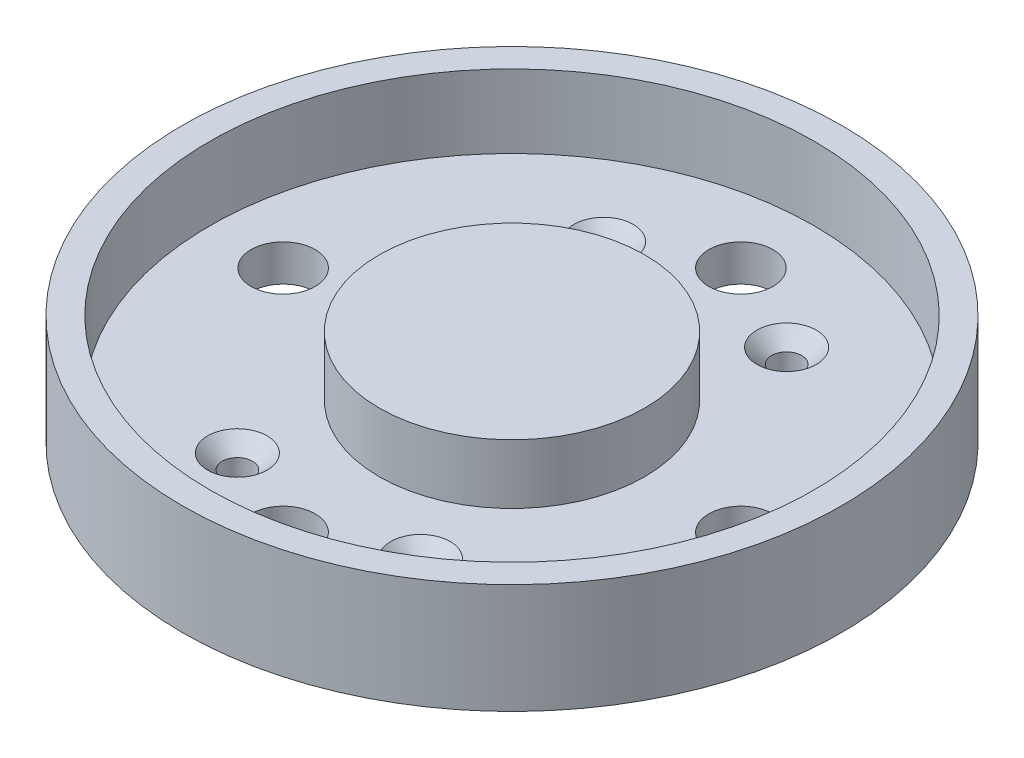
ISO-10303-21;
HEADER;
FILE_DESCRIPTION(('STEP AP214'),'2;1');
FILE_NAME('part.step','',(''),(''),'','','');
FILE_SCHEMA(('AUTOMOTIVE_DESIGN { 1 0 10303 214 1 1 1 1 }'));
ENDSEC;
DATA;
#1=APPLICATION_CONTEXT('core data for automotive mechanical design processes');
#2=APPLICATION_PROTOCOL_DEFINITION('international standard','automotive_design',2000,#1);
#3=PRODUCT_CONTEXT('',#1,'mechanical');
#4=PRODUCT('Part','Part','',(#3));
#5=PRODUCT_RELATED_PRODUCT_CATEGORY('part','',(#4));
#6=PRODUCT_DEFINITION_FORMATION('','',#4);
#7=PRODUCT_DEFINITION_CONTEXT('part definition',#1,'design');
#8=PRODUCT_DEFINITION('design','',#6,#7);
#9=PRODUCT_DEFINITION_SHAPE('','',#8);
#10=(LENGTH_UNIT() NAMED_UNIT(*) SI_UNIT(.MILLI.,.METRE.));
#11=(NAMED_UNIT(*) PLANE_ANGLE_UNIT() SI_UNIT($,.RADIAN.));
#12=(NAMED_UNIT(*) SI_UNIT($,.STERADIAN.) SOLID_ANGLE_UNIT());
#13=UNCERTAINTY_MEASURE_WITH_UNIT(LENGTH_MEASURE(1.E-05),#10,'distance_accuracy_value','');
#14=(GEOMETRIC_REPRESENTATION_CONTEXT(3) GLOBAL_UNCERTAINTY_ASSIGNED_CONTEXT((#13)) GLOBAL_UNIT_ASSIGNED_CONTEXT((#10,
#11,#12)) REPRESENTATION_CONTEXT('',''));
#15=CARTESIAN_POINT('',(0.,0.,0.));
#16=DIRECTION('',(0.,0.,1.));
#17=DIRECTION('',(1.,0.,0.));
#18=AXIS2_PLACEMENT_3D('',#15,#16,#17);
#19=CARTESIAN_POINT('',(0.,4.,0.));
#20=DIRECTION('',(0.,1.,0.));
#21=DIRECTION('',(0.,0.,1.));
#22=AXIS2_PLACEMENT_3D('',#19,#20,#21);
#23=PLANE('',#22);
#24=CARTESIAN_POINT('',(-10.,4.,20.));
#25=DIRECTION('',(0.,1.,0.));
#26=DIRECTION('',(0.,0.,1.));
#27=AXIS2_PLACEMENT_3D('',#24,#25,#26);
#28=CIRCLE('',#27,3.24999999999998);
#29=CARTESIAN_POINT('',(-10.,4.,23.25));
#30=VERTEX_POINT('',#29);
#31=EDGE_CURVE('E51',#30,#30,#28,.F.);
#32=ORIENTED_EDGE('',*,*,#31,.T.);
#33=EDGE_LOOP('',(#32));
#34=FACE_BOUND('',#33,.T.);
#35=CARTESIAN_POINT('',(10.,4.,20.));
#36=DIRECTION('',(0.,1.,0.));
#37=DIRECTION('',(0.,0.,1.));
#38=AXIS2_PLACEMENT_3D('',#35,#36,#37);
#39=CIRCLE('',#38,3.25000000000001);
#40=CARTESIAN_POINT('',(10.,4.,23.25));
#41=VERTEX_POINT('',#40);
#42=EDGE_CURVE('E56',#41,#41,#39,.F.);
#43=ORIENTED_EDGE('',*,*,#42,.T.);
#44=EDGE_LOOP('',(#43));
#45=FACE_BOUND('',#44,.T.);
#46=CARTESIAN_POINT('',(10.,4.,-20.));
#47=DIRECTION('',(0.,1.,0.));
#48=DIRECTION('',(0.,0.,1.));
#49=AXIS2_PLACEMENT_3D('',#46,#47,#48);
#50=CIRCLE('',#49,3.25000000000001);
#51=CARTESIAN_POINT('',(10.,4.,-16.75));
#52=VERTEX_POINT('',#51);
#53=EDGE_CURVE('E59',#52,#52,#50,.F.);
#54=ORIENTED_EDGE('',*,*,#53,.T.);
#55=EDGE_LOOP('',(#54));
#56=FACE_BOUND('',#55,.T.);
#57=CARTESIAN_POINT('',(-10.,4.,-20.));
#58=DIRECTION('',(0.,1.,0.));
#59=DIRECTION('',(0.,0.,1.));
#60=AXIS2_PLACEMENT_3D('',#57,#58,#59);
#61=CIRCLE('',#60,3.24999999999998);
#62=CARTESIAN_POINT('',(-10.,4.,-16.75));
#63=VERTEX_POINT('',#62);
#64=EDGE_CURVE('E62',#63,#63,#61,.F.);
#65=ORIENTED_EDGE('',*,*,#64,.T.);
#66=EDGE_LOOP('',(#65));
#67=FACE_BOUND('',#66,.T.);
#68=CARTESIAN_POINT('',(-24.9999999999993,4.,7.09011927261166E-13));
#69=DIRECTION('',(0.,1.,0.));
#70=DIRECTION('',(0.,0.,1.));
#71=AXIS2_PLACEMENT_3D('',#68,#69,#70);
#72=CIRCLE('',#71,3.50000000000113);
#73=CARTESIAN_POINT('',(-24.9999999999993,4.,3.50000000000184));
#74=VERTEX_POINT('',#73);
#75=EDGE_CURVE('E102',#74,#74,#72,.T.);
#76=ORIENTED_EDGE('',*,*,#75,.F.);
#77=EDGE_LOOP('',(#76));
#78=FACE_BOUND('',#77,.T.);
#79=CARTESIAN_POINT('',(0.,4.,-25.));
#80=DIRECTION('',(0.,1.,0.));
#81=DIRECTION('',(0.,0.,1.));
#82=AXIS2_PLACEMENT_3D('',#79,#80,#81);
#83=CIRCLE('',#82,3.5);
#84=CARTESIAN_POINT('',(0.,4.,-21.5));
#85=VERTEX_POINT('',#84);
#86=EDGE_CURVE('E74',#85,#85,#83,.T.);
#87=ORIENTED_EDGE('',*,*,#86,.F.);
#88=EDGE_LOOP('',(#87));
#89=FACE_BOUND('',#88,.T.);
#90=CARTESIAN_POINT('',(25.0000000000007,4.,-7.05950310263298E-13));
#91=DIRECTION('',(0.,1.,0.));
#92=DIRECTION('',(0.,0.,1.));
#93=AXIS2_PLACEMENT_3D('',#90,#91,#92);
#94=CIRCLE('',#93,3.50000000000055);
#95=CARTESIAN_POINT('',(25.0000000000007,4.,3.49999999999985));
#96=VERTEX_POINT('',#95);
#97=EDGE_CURVE('E89',#96,#96,#94,.T.);
#98=ORIENTED_EDGE('',*,*,#97,.F.);
#99=EDGE_LOOP('',(#98));
#100=FACE_BOUND('',#99,.T.);
#101=CARTESIAN_POINT('',(1.4119006205266E-12,4.,25.));
#102=DIRECTION('',(0.,1.,0.));
#103=DIRECTION('',(0.,0.,1.));
#104=AXIS2_PLACEMENT_3D('',#101,#102,#103);
#105=CIRCLE('',#104,3.50000000000152);
#106=CARTESIAN_POINT('',(1.4119006205266E-12,4.,28.5000000000015));
#107=VERTEX_POINT('',#106);
#108=EDGE_CURVE('E98',#107,#107,#105,.T.);
#109=ORIENTED_EDGE('',*,*,#108,.F.);
#110=EDGE_LOOP('',(#109));
#111=FACE_BOUND('',#110,.T.);
#112=CARTESIAN_POINT('',(0.,4.,0.));
#113=DIRECTION('',(0.,1.,0.));
#114=DIRECTION('',(0.,0.,1.));
#115=AXIS2_PLACEMENT_3D('',#112,#113,#114);
#116=CIRCLE('',#115,14.5);
#117=CARTESIAN_POINT('',(0.,4.,14.5));
#118=VERTEX_POINT('',#117);
#119=EDGE_CURVE('E111',#118,#118,#116,.T.);
#120=ORIENTED_EDGE('',*,*,#119,.F.);
#121=EDGE_LOOP('',(#120));
#122=FACE_BOUND('',#121,.T.);
#123=CARTESIAN_POINT('',(0.,4.,0.));
#124=DIRECTION('',(0.,1.,0.));
#125=DIRECTION('',(0.,0.,1.));
#126=AXIS2_PLACEMENT_3D('',#123,#124,#125);
#127=CIRCLE('',#126,33.);
#128=CARTESIAN_POINT('',(0.,4.,33.));
#129=VERTEX_POINT('',#128);
#130=EDGE_CURVE('E68',#129,#129,#127,.F.);
#131=ORIENTED_EDGE('',*,*,#130,.F.);
#132=EDGE_LOOP('',(#131));
#133=FACE_BOUND('',#132,.T.);
#134=ADVANCED_FACE('F35',(#34,#45,#56,#67,#78,#89,#100,#111,#122,#133),#23,.T.);
#135=CARTESIAN_POINT('',(0.,0.,0.));
#136=DIRECTION('',(0.,1.,0.));
#137=DIRECTION('',(0.,0.,1.));
#138=AXIS2_PLACEMENT_3D('',#135,#136,#137);
#139=PLANE('',#138);
#140=CARTESIAN_POINT('',(0.,0.,0.));
#141=DIRECTION('',(0.,1.,0.));
#142=DIRECTION('',(0.,0.,1.));
#143=AXIS2_PLACEMENT_3D('',#140,#141,#142);
#144=CIRCLE('',#143,36.);
#145=CARTESIAN_POINT('',(0.,0.,36.));
#146=VERTEX_POINT('',#145);
#147=EDGE_CURVE('E71',#146,#146,#144,.T.);
#148=ORIENTED_EDGE('',*,*,#147,.F.);
#149=EDGE_LOOP('',(#148));
#150=FACE_BOUND('',#149,.T.);
#151=CARTESIAN_POINT('',(0.,0.,-25.));
#152=DIRECTION('',(0.,1.,0.));
#153=DIRECTION('',(0.,0.,1.));
#154=AXIS2_PLACEMENT_3D('',#151,#152,#153);
#155=CIRCLE('',#154,3.5);
#156=CARTESIAN_POINT('',(0.,0.,-21.5));
#157=VERTEX_POINT('',#156);
#158=EDGE_CURVE('E75',#157,#157,#155,.T.);
#159=ORIENTED_EDGE('',*,*,#158,.T.);
#160=EDGE_LOOP('',(#159));
#161=FACE_BOUND('',#160,.T.);
#162=CARTESIAN_POINT('',(-10.,0.,-20.));
#163=DIRECTION('',(0.,1.,0.));
#164=DIRECTION('',(0.,0.,1.));
#165=AXIS2_PLACEMENT_3D('',#162,#163,#164);
#166=CIRCLE('',#165,1.65);
#167=CARTESIAN_POINT('',(-10.,0.,-18.35));
#168=VERTEX_POINT('',#167);
#169=EDGE_CURVE('E78',#168,#168,#166,.T.);
#170=ORIENTED_EDGE('',*,*,#169,.T.);
#171=EDGE_LOOP('',(#170));
#172=FACE_BOUND('',#171,.T.);
#173=CARTESIAN_POINT('',(10.,0.,-20.));
#174=DIRECTION('',(0.,1.,0.));
#175=DIRECTION('',(0.,0.,-1.));
#176=AXIS2_PLACEMENT_3D('',#173,#174,#175);
#177=CIRCLE('',#176,1.65);
#178=CARTESIAN_POINT('',(10.,0.,-21.65));
#179=VERTEX_POINT('',#178);
#180=EDGE_CURVE('E83',#179,#179,#177,.T.);
#181=ORIENTED_EDGE('',*,*,#180,.T.);
#182=EDGE_LOOP('',(#181));
#183=FACE_BOUND('',#182,.T.);
#184=CARTESIAN_POINT('',(10.,0.,20.));
#185=DIRECTION('',(0.,1.,0.));
#186=DIRECTION('',(0.,0.,1.));
#187=AXIS2_PLACEMENT_3D('',#184,#185,#186);
#188=CIRCLE('',#187,1.65);
#189=CARTESIAN_POINT('',(10.,0.,21.65));
#190=VERTEX_POINT('',#189);
#191=EDGE_CURVE('E86',#190,#190,#188,.T.);
#192=ORIENTED_EDGE('',*,*,#191,.T.);
#193=EDGE_LOOP('',(#192));
#194=FACE_BOUND('',#193,.T.);
#195=CARTESIAN_POINT('',(25.0000000000007,0.,-7.05950310263298E-13));
#196=DIRECTION('',(0.,1.,0.));
#197=DIRECTION('',(0.,0.,1.));
#198=AXIS2_PLACEMENT_3D('',#195,#196,#197);
#199=CIRCLE('',#198,3.50000000000055);
#200=CARTESIAN_POINT('',(25.0000000000007,0.,3.49999999999985));
#201=VERTEX_POINT('',#200);
#202=EDGE_CURVE('E90',#201,#201,#199,.T.);
#203=ORIENTED_EDGE('',*,*,#202,.T.);
#204=EDGE_LOOP('',(#203));
#205=FACE_BOUND('',#204,.T.);
#206=CARTESIAN_POINT('',(-10.,0.,20.));
#207=DIRECTION('',(0.,1.,0.));
#208=DIRECTION('',(0.,0.,-1.));
#209=AXIS2_PLACEMENT_3D('',#206,#207,#208);
#210=CIRCLE('',#209,1.65);
#211=CARTESIAN_POINT('',(-10.,0.,18.35));
#212=VERTEX_POINT('',#211);
#213=EDGE_CURVE('E93',#212,#212,#210,.T.);
#214=ORIENTED_EDGE('',*,*,#213,.T.);
#215=EDGE_LOOP('',(#214));
#216=FACE_BOUND('',#215,.T.);
#217=CARTESIAN_POINT('',(1.4119006205266E-12,0.,25.));
#218=DIRECTION('',(0.,1.,0.));
#219=DIRECTION('',(0.,0.,1.));
#220=AXIS2_PLACEMENT_3D('',#217,#218,#219);
#221=CIRCLE('',#220,3.50000000000152);
#222=CARTESIAN_POINT('',(1.4119006205266E-12,0.,28.5000000000015));
#223=VERTEX_POINT('',#222);
#224=EDGE_CURVE('E99',#223,#223,#221,.T.);
#225=ORIENTED_EDGE('',*,*,#224,.T.);
#226=EDGE_LOOP('',(#225));
#227=FACE_BOUND('',#226,.T.);
#228=CARTESIAN_POINT('',(-24.9999999999993,0.,7.09011927261166E-13));
#229=DIRECTION('',(0.,1.,0.));
#230=DIRECTION('',(0.,0.,1.));
#231=AXIS2_PLACEMENT_3D('',#228,#229,#230);
#232=CIRCLE('',#231,3.50000000000113);
#233=CARTESIAN_POINT('',(-24.9999999999993,0.,3.50000000000184));
#234=VERTEX_POINT('',#233);
#235=EDGE_CURVE('E105',#234,#234,#232,.T.);
#236=ORIENTED_EDGE('',*,*,#235,.T.);
#237=EDGE_LOOP('',(#236));
#238=FACE_BOUND('',#237,.T.);
#239=ADVANCED_FACE('F141',(#150,#161,#172,#183,#194,#205,#216,#227,#238),#139,.F.);
#240=CARTESIAN_POINT('',(0.,4.,0.));
#241=DIRECTION('',(0.,-1.,0.));
#242=DIRECTION('',(0.,0.,-1.));
#243=AXIS2_PLACEMENT_3D('',#240,#241,#242);
#244=CYLINDRICAL_SURFACE('',#243,36.);
#245=ORIENTED_EDGE('',*,*,#147,.T.);
#246=EDGE_LOOP('',(#245));
#247=FACE_BOUND('',#246,.T.);
#248=CARTESIAN_POINT('',(0.,12.,0.));
#249=DIRECTION('',(0.,1.,0.));
#250=DIRECTION('',(0.,0.,1.));
#251=AXIS2_PLACEMENT_3D('',#248,#249,#250);
#252=CIRCLE('',#251,36.);
#253=CARTESIAN_POINT('',(0.,12.,36.));
#254=VERTEX_POINT('',#253);
#255=EDGE_CURVE('E114',#254,#254,#252,.T.);
#256=ORIENTED_EDGE('',*,*,#255,.F.);
#257=EDGE_LOOP('',(#256));
#258=FACE_BOUND('',#257,.T.);
#259=ADVANCED_FACE('F147',(#247,#258),#244,.T.);
#260=CARTESIAN_POINT('',(0.,4.,-25.));
#261=DIRECTION('',(0.,-1.,0.));
#262=DIRECTION('',(0.,0.,-1.));
#263=AXIS2_PLACEMENT_3D('',#260,#261,#262);
#264=CYLINDRICAL_SURFACE('',#263,3.5);
#265=ORIENTED_EDGE('',*,*,#86,.T.);
#266=EDGE_LOOP('',(#265));
#267=FACE_BOUND('',#266,.T.);
#268=ORIENTED_EDGE('',*,*,#158,.F.);
#269=EDGE_LOOP('',(#268));
#270=FACE_BOUND('',#269,.T.);
#271=ADVANCED_FACE('F152',(#267,#270),#264,.F.);
#272=CARTESIAN_POINT('',(-10.,4.,-20.));
#273=DIRECTION('',(0.,-1.,0.));
#274=DIRECTION('',(0.,0.,-1.));
#275=AXIS2_PLACEMENT_3D('',#272,#273,#274);
#276=CYLINDRICAL_SURFACE('',#275,1.65);
#277=CARTESIAN_POINT('',(-10.,2.40000000000002,-20.));
#278=DIRECTION('',(0.,1.,0.));
#279=DIRECTION('',(0.,0.,1.));
#280=AXIS2_PLACEMENT_3D('',#277,#278,#279);
#281=CIRCLE('',#280,1.65);
#282=CARTESIAN_POINT('',(-10.,2.40000000000002,-18.35));
#283=VERTEX_POINT('',#282);
#284=EDGE_CURVE('E10',#283,#283,#281,.T.);
#285=ORIENTED_EDGE('',*,*,#284,.T.);
#286=EDGE_LOOP('',(#285));
#287=FACE_BOUND('',#286,.T.);
#288=ORIENTED_EDGE('',*,*,#169,.F.);
#289=EDGE_LOOP('',(#288));
#290=FACE_BOUND('',#289,.T.);
#291=ADVANCED_FACE('F227',(#287,#290),#276,.F.);
#292=CARTESIAN_POINT('',(10.,4.,-20.));
#293=DIRECTION('',(0.,-1.,0.));
#294=DIRECTION('',(0.,0.,-1.));
#295=AXIS2_PLACEMENT_3D('',#292,#293,#294);
#296=CYLINDRICAL_SURFACE('',#295,1.65);
#297=CARTESIAN_POINT('',(10.,2.40000000000001,-20.));
#298=DIRECTION('',(0.,1.,0.));
#299=DIRECTION('',(0.,0.,1.));
#300=AXIS2_PLACEMENT_3D('',#297,#298,#299);
#301=CIRCLE('',#300,1.65);
#302=CARTESIAN_POINT('',(10.,2.40000000000001,-18.35));
#303=VERTEX_POINT('',#302);
#304=EDGE_CURVE('E43',#303,#303,#301,.T.);
#305=ORIENTED_EDGE('',*,*,#304,.T.);
#306=EDGE_LOOP('',(#305));
#307=FACE_BOUND('',#306,.T.);
#308=ORIENTED_EDGE('',*,*,#180,.F.);
#309=EDGE_LOOP('',(#308));
#310=FACE_BOUND('',#309,.T.);
#311=ADVANCED_FACE('F224',(#307,#310),#296,.F.);
#312=CARTESIAN_POINT('',(10.,4.,20.));
#313=DIRECTION('',(0.,-1.,0.));
#314=DIRECTION('',(0.,0.,-1.));
#315=AXIS2_PLACEMENT_3D('',#312,#313,#314);
#316=CYLINDRICAL_SURFACE('',#315,1.65);
#317=CARTESIAN_POINT('',(10.,2.40000000000001,20.));
#318=DIRECTION('',(0.,1.,0.));
#319=DIRECTION('',(0.,0.,1.));
#320=AXIS2_PLACEMENT_3D('',#317,#318,#319);
#321=CIRCLE('',#320,1.65);
#322=CARTESIAN_POINT('',(10.,2.40000000000001,21.65));
#323=VERTEX_POINT('',#322);
#324=EDGE_CURVE('E47',#323,#323,#321,.T.);
#325=ORIENTED_EDGE('',*,*,#324,.T.);
#326=EDGE_LOOP('',(#325));
#327=FACE_BOUND('',#326,.T.);
#328=ORIENTED_EDGE('',*,*,#191,.F.);
#329=EDGE_LOOP('',(#328));
#330=FACE_BOUND('',#329,.T.);
#331=ADVANCED_FACE('F220',(#327,#330),#316,.F.);
#332=CARTESIAN_POINT('',(25.0000000000007,4.,-7.05950310263298E-13));
#333=DIRECTION('',(0.,-1.,0.));
#334=DIRECTION('',(0.,0.,-1.));
#335=AXIS2_PLACEMENT_3D('',#332,#333,#334);
#336=CYLINDRICAL_SURFACE('',#335,3.50000000000055);
#337=ORIENTED_EDGE('',*,*,#97,.T.);
#338=EDGE_LOOP('',(#337));
#339=FACE_BOUND('',#338,.T.);
#340=ORIENTED_EDGE('',*,*,#202,.F.);
#341=EDGE_LOOP('',(#340));
#342=FACE_BOUND('',#341,.T.);
#343=ADVANCED_FACE('F216',(#339,#342),#336,.F.);
#344=CARTESIAN_POINT('',(-10.,4.,20.));
#345=DIRECTION('',(0.,-1.,0.));
#346=DIRECTION('',(0.,0.,-1.));
#347=AXIS2_PLACEMENT_3D('',#344,#345,#346);
#348=CYLINDRICAL_SURFACE('',#347,1.65);
#349=CARTESIAN_POINT('',(-10.,2.40000000000002,20.));
#350=DIRECTION('',(0.,1.,0.));
#351=DIRECTION('',(0.,0.,1.));
#352=AXIS2_PLACEMENT_3D('',#349,#350,#351);
#353=CIRCLE('',#352,1.65);
#354=CARTESIAN_POINT('',(-10.,2.40000000000002,21.65));
#355=VERTEX_POINT('',#354);
#356=EDGE_CURVE('E65',#355,#355,#353,.T.);
#357=ORIENTED_EDGE('',*,*,#356,.T.);
#358=EDGE_LOOP('',(#357));
#359=FACE_BOUND('',#358,.T.);
#360=ORIENTED_EDGE('',*,*,#213,.F.);
#361=EDGE_LOOP('',(#360));
#362=FACE_BOUND('',#361,.T.);
#363=ADVANCED_FACE('F212',(#359,#362),#348,.F.);
#364=CARTESIAN_POINT('',(1.4119006205266E-12,4.,25.));
#365=DIRECTION('',(0.,-1.,0.));
#366=DIRECTION('',(0.,0.,-1.));
#367=AXIS2_PLACEMENT_3D('',#364,#365,#366);
#368=CYLINDRICAL_SURFACE('',#367,3.50000000000152);
#369=ORIENTED_EDGE('',*,*,#108,.T.);
#370=EDGE_LOOP('',(#369));
#371=FACE_BOUND('',#370,.T.);
#372=ORIENTED_EDGE('',*,*,#224,.F.);
#373=EDGE_LOOP('',(#372));
#374=FACE_BOUND('',#373,.T.);
#375=ADVANCED_FACE('F205',(#371,#374),#368,.F.);
#376=CARTESIAN_POINT('',(-24.9999999999993,4.,7.09011927261166E-13));
#377=DIRECTION('',(0.,-1.,0.));
#378=DIRECTION('',(0.,0.,-1.));
#379=AXIS2_PLACEMENT_3D('',#376,#377,#378);
#380=CYLINDRICAL_SURFACE('',#379,3.50000000000113);
#381=ORIENTED_EDGE('',*,*,#75,.T.);
#382=EDGE_LOOP('',(#381));
#383=FACE_BOUND('',#382,.T.);
#384=ORIENTED_EDGE('',*,*,#235,.F.);
#385=EDGE_LOOP('',(#384));
#386=FACE_BOUND('',#385,.T.);
#387=ADVANCED_FACE('F199',(#383,#386),#380,.F.);
#388=CARTESIAN_POINT('',(0.,10.5,0.));
#389=DIRECTION('',(0.,-1.,0.));
#390=DIRECTION('',(0.,0.,-1.));
#391=AXIS2_PLACEMENT_3D('',#388,#389,#390);
#392=CYLINDRICAL_SURFACE('',#391,14.5);
#393=CARTESIAN_POINT('',(0.,10.5,0.));
#394=DIRECTION('',(0.,1.,0.));
#395=DIRECTION('',(0.,0.,1.));
#396=AXIS2_PLACEMENT_3D('',#393,#394,#395);
#397=CIRCLE('',#396,14.5);
#398=CARTESIAN_POINT('',(0.,10.5,14.5));
#399=VERTEX_POINT('',#398);
#400=EDGE_CURVE('E108',#399,#399,#397,.T.);
#401=ORIENTED_EDGE('',*,*,#400,.F.);
#402=EDGE_LOOP('',(#401));
#403=FACE_BOUND('',#402,.T.);
#404=ORIENTED_EDGE('',*,*,#119,.T.);
#405=EDGE_LOOP('',(#404));
#406=FACE_BOUND('',#405,.T.);
#407=ADVANCED_FACE('F137',(#403,#406),#392,.T.);
#408=CARTESIAN_POINT('',(0.,10.5,0.));
#409=DIRECTION('',(0.,1.,0.));
#410=DIRECTION('',(0.,0.,1.));
#411=AXIS2_PLACEMENT_3D('',#408,#409,#410);
#412=PLANE('',#411);
#413=ORIENTED_EDGE('',*,*,#400,.T.);
#414=EDGE_LOOP('',(#413));
#415=FACE_BOUND('',#414,.T.);
#416=ADVANCED_FACE('F128',(#415),#412,.T.);
#417=CARTESIAN_POINT('',(0.,12.,0.));
#418=DIRECTION('',(0.,1.,0.));
#419=DIRECTION('',(0.,0.,1.));
#420=AXIS2_PLACEMENT_3D('',#417,#418,#419);
#421=PLANE('',#420);
#422=ORIENTED_EDGE('',*,*,#255,.T.);
#423=EDGE_LOOP('',(#422));
#424=FACE_BOUND('',#423,.T.);
#425=CARTESIAN_POINT('',(0.,12.,0.));
#426=DIRECTION('',(0.,1.,0.));
#427=DIRECTION('',(0.,0.,1.));
#428=AXIS2_PLACEMENT_3D('',#425,#426,#427);
#429=CIRCLE('',#428,33.);
#430=CARTESIAN_POINT('',(0.,12.,33.));
#431=VERTEX_POINT('',#430);
#432=EDGE_CURVE('E119',#431,#431,#429,.T.);
#433=ORIENTED_EDGE('',*,*,#432,.F.);
#434=EDGE_LOOP('',(#433));
#435=FACE_BOUND('',#434,.T.);
#436=ADVANCED_FACE('F126',(#424,#435),#421,.T.);
#437=CARTESIAN_POINT('',(0.,12.,0.));
#438=DIRECTION('',(0.,-1.,0.));
#439=DIRECTION('',(0.,0.,-1.));
#440=AXIS2_PLACEMENT_3D('',#437,#438,#439);
#441=CYLINDRICAL_SURFACE('',#440,33.);
#442=ORIENTED_EDGE('',*,*,#432,.T.);
#443=EDGE_LOOP('',(#442));
#444=FACE_BOUND('',#443,.T.);
#445=ORIENTED_EDGE('',*,*,#130,.T.);
#446=EDGE_LOOP('',(#445));
#447=FACE_BOUND('',#446,.T.);
#448=ADVANCED_FACE('F123',(#444,#447),#441,.F.);
#449=CARTESIAN_POINT('',(-10.,2.40000000000002,20.));
#450=DIRECTION('',(0.,1.,0.));
#451=DIRECTION('',(0.,0.,1.));
#452=AXIS2_PLACEMENT_3D('',#449,#450,#451);
#453=CONICAL_SURFACE('',#452,1.65,0.785398163397448);
#454=ORIENTED_EDGE('',*,*,#31,.F.);
#455=EDGE_LOOP('',(#454));
#456=FACE_BOUND('',#455,.T.);
#457=ORIENTED_EDGE('',*,*,#356,.F.);
#458=EDGE_LOOP('',(#457));
#459=FACE_BOUND('',#458,.T.);
#460=ADVANCED_FACE('F135',(#456,#459),#453,.F.);
#461=CARTESIAN_POINT('',(10.,2.40000000000001,20.));
#462=DIRECTION('',(0.,1.,0.));
#463=DIRECTION('',(0.,0.,1.));
#464=AXIS2_PLACEMENT_3D('',#461,#462,#463);
#465=CONICAL_SURFACE('',#464,1.65,0.785398163397452);
#466=ORIENTED_EDGE('',*,*,#42,.F.);
#467=EDGE_LOOP('',(#466));
#468=FACE_BOUND('',#467,.T.);
#469=ORIENTED_EDGE('',*,*,#324,.F.);
#470=EDGE_LOOP('',(#469));
#471=FACE_BOUND('',#470,.T.);
#472=ADVANCED_FACE('F164',(#468,#471),#465,.F.);
#473=CARTESIAN_POINT('',(10.,2.40000000000001,-20.));
#474=DIRECTION('',(0.,1.,0.));
#475=DIRECTION('',(0.,0.,1.));
#476=AXIS2_PLACEMENT_3D('',#473,#474,#475);
#477=CONICAL_SURFACE('',#476,1.65,0.785398163397452);
#478=ORIENTED_EDGE('',*,*,#53,.F.);
#479=EDGE_LOOP('',(#478));
#480=FACE_BOUND('',#479,.T.);
#481=ORIENTED_EDGE('',*,*,#304,.F.);
#482=EDGE_LOOP('',(#481));
#483=FACE_BOUND('',#482,.T.);
#484=ADVANCED_FACE('F170',(#480,#483),#477,.F.);
#485=CARTESIAN_POINT('',(-10.,2.40000000000002,-20.));
#486=DIRECTION('',(0.,1.,0.));
#487=DIRECTION('',(0.,0.,1.));
#488=AXIS2_PLACEMENT_3D('',#485,#486,#487);
#489=CONICAL_SURFACE('',#488,1.65,0.785398163397448);
#490=ORIENTED_EDGE('',*,*,#64,.F.);
#491=EDGE_LOOP('',(#490));
#492=FACE_BOUND('',#491,.T.);
#493=ORIENTED_EDGE('',*,*,#284,.F.);
#494=EDGE_LOOP('',(#493));
#495=FACE_BOUND('',#494,.T.);
#496=ADVANCED_FACE('F38',(#492,#495),#489,.F.);
#497=CLOSED_SHELL('',(#134,#239,#259,#271,#291,#311,#331,#343,#363,#375,#387,#407,#416,#436,
#448,#460,#472,#484,#496));
#498=MANIFOLD_SOLID_BREP('B2',#497);
#499=ADVANCED_BREP_SHAPE_REPRESENTATION('',(#18,#498),#14);
#500=SHAPE_DEFINITION_REPRESENTATION(#9,#499);
ENDSEC;
END-ISO-10303-21;
